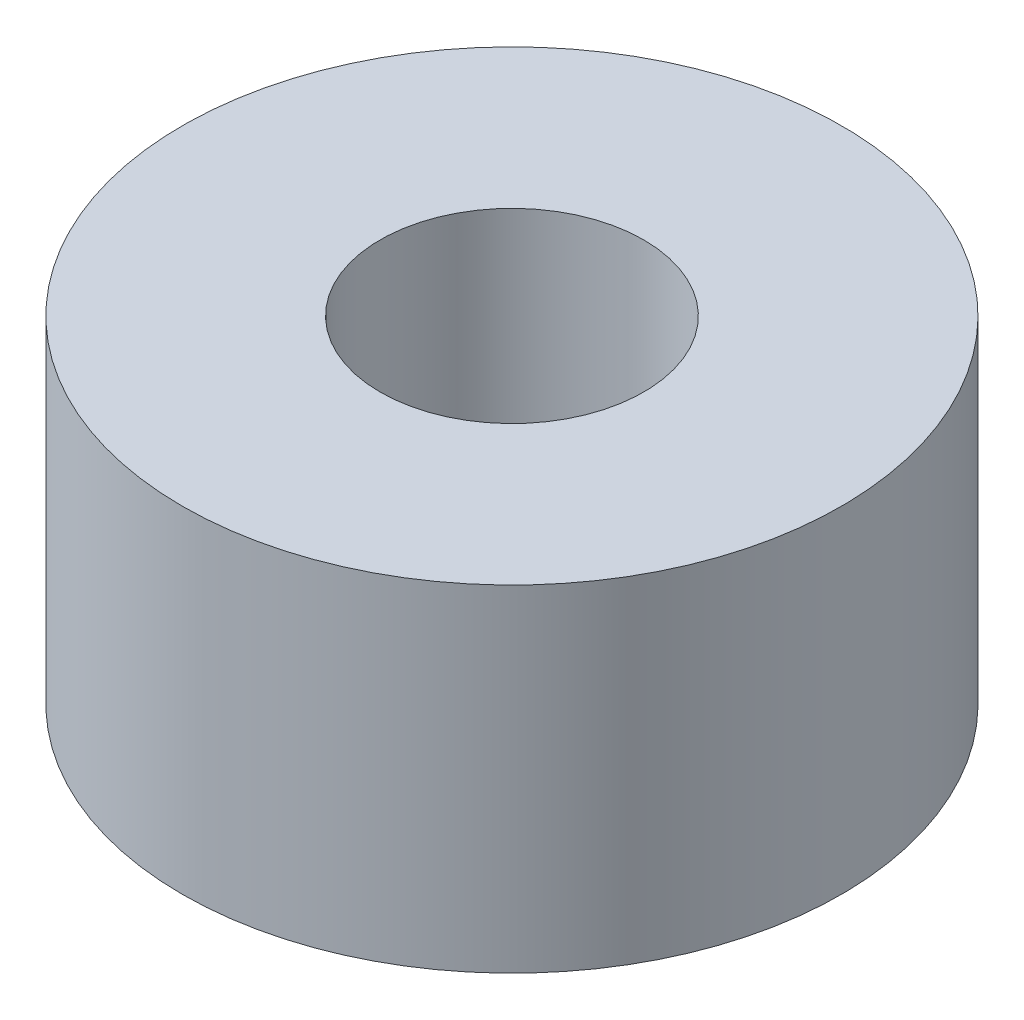
ISO-10303-21;
HEADER;
FILE_DESCRIPTION(('STEP AP214'),'2;1');
FILE_NAME('part.step','',(''),(''),'','','');
FILE_SCHEMA(('AUTOMOTIVE_DESIGN { 1 0 10303 214 1 1 1 1 }'));
ENDSEC;
DATA;
#1=APPLICATION_CONTEXT('core data for automotive mechanical design processes');
#2=APPLICATION_PROTOCOL_DEFINITION('international standard','automotive_design',2000,#1);
#3=PRODUCT_CONTEXT('',#1,'mechanical');
#4=PRODUCT('Part','Part','',(#3));
#5=PRODUCT_RELATED_PRODUCT_CATEGORY('part','',(#4));
#6=PRODUCT_DEFINITION_FORMATION('','',#4);
#7=PRODUCT_DEFINITION_CONTEXT('part definition',#1,'design');
#8=PRODUCT_DEFINITION('design','',#6,#7);
#9=PRODUCT_DEFINITION_SHAPE('','',#8);
#10=(LENGTH_UNIT() NAMED_UNIT(*) SI_UNIT(.MILLI.,.METRE.));
#11=(NAMED_UNIT(*) PLANE_ANGLE_UNIT() SI_UNIT($,.RADIAN.));
#12=(NAMED_UNIT(*) SI_UNIT($,.STERADIAN.) SOLID_ANGLE_UNIT());
#13=UNCERTAINTY_MEASURE_WITH_UNIT(LENGTH_MEASURE(1.E-05),#10,'distance_accuracy_value','');
#14=(GEOMETRIC_REPRESENTATION_CONTEXT(3) GLOBAL_UNCERTAINTY_ASSIGNED_CONTEXT((#13)) GLOBAL_UNIT_ASSIGNED_CONTEXT((#10,
#11,#12)) REPRESENTATION_CONTEXT('',''));
#15=CARTESIAN_POINT('',(0.,0.,0.));
#16=DIRECTION('',(0.,0.,1.));
#17=DIRECTION('',(1.,0.,0.));
#18=AXIS2_PLACEMENT_3D('',#15,#16,#17);
#19=CARTESIAN_POINT('',(0.,2.55,0.));
#20=DIRECTION('',(0.,1.,0.));
#21=DIRECTION('',(0.,0.,1.));
#22=AXIS2_PLACEMENT_3D('',#19,#20,#21);
#23=PLANE('',#22);
#24=CARTESIAN_POINT('',(0.,2.55,0.));
#25=DIRECTION('',(0.,1.,0.));
#26=DIRECTION('',(0.,0.,1.));
#27=AXIS2_PLACEMENT_3D('',#24,#25,#26);
#28=CIRCLE('',#27,5.);
#29=CARTESIAN_POINT('',(0.,2.55,5.));
#30=VERTEX_POINT('',#29);
#31=EDGE_CURVE('E10',#30,#30,#28,.T.);
#32=ORIENTED_EDGE('',*,*,#31,.T.);
#33=EDGE_LOOP('',(#32));
#34=FACE_BOUND('',#33,.T.);
#35=CARTESIAN_POINT('',(0.,2.55,0.));
#36=DIRECTION('',(0.,1.,0.));
#37=DIRECTION('',(0.,0.,1.));
#38=AXIS2_PLACEMENT_3D('',#35,#36,#37);
#39=CIRCLE('',#38,2.);
#40=CARTESIAN_POINT('',(0.,2.55,2.));
#41=VERTEX_POINT('',#40);
#42=EDGE_CURVE('E50',#41,#41,#39,.T.);
#43=ORIENTED_EDGE('',*,*,#42,.F.);
#44=EDGE_LOOP('',(#43));
#45=FACE_BOUND('',#44,.T.);
#46=ADVANCED_FACE('F37',(#34,#45),#23,.T.);
#47=CARTESIAN_POINT('',(0.,-2.55,0.));
#48=DIRECTION('',(0.,1.,0.));
#49=DIRECTION('',(0.,0.,1.));
#50=AXIS2_PLACEMENT_3D('',#47,#48,#49);
#51=PLANE('',#50);
#52=CARTESIAN_POINT('',(0.,-2.55,0.));
#53=DIRECTION('',(0.,1.,0.));
#54=DIRECTION('',(0.,0.,1.));
#55=AXIS2_PLACEMENT_3D('',#52,#53,#54);
#56=CIRCLE('',#55,5.);
#57=CARTESIAN_POINT('',(0.,-2.55,5.));
#58=VERTEX_POINT('',#57);
#59=EDGE_CURVE('E41',#58,#58,#56,.T.);
#60=ORIENTED_EDGE('',*,*,#59,.F.);
#61=EDGE_LOOP('',(#60));
#62=FACE_BOUND('',#61,.T.);
#63=CARTESIAN_POINT('',(0.,-2.55,0.));
#64=DIRECTION('',(0.,1.,0.));
#65=DIRECTION('',(0.,0.,1.));
#66=AXIS2_PLACEMENT_3D('',#63,#64,#65);
#67=CIRCLE('',#66,2.);
#68=CARTESIAN_POINT('',(0.,-2.55,2.));
#69=VERTEX_POINT('',#68);
#70=EDGE_CURVE('E52',#69,#69,#67,.T.);
#71=ORIENTED_EDGE('',*,*,#70,.T.);
#72=EDGE_LOOP('',(#71));
#73=FACE_BOUND('',#72,.T.);
#74=ADVANCED_FACE('F64',(#62,#73),#51,.F.);
#75=CARTESIAN_POINT('',(0.,2.55,0.));
#76=DIRECTION('',(0.,-1.,0.));
#77=DIRECTION('',(0.,0.,-1.));
#78=AXIS2_PLACEMENT_3D('',#75,#76,#77);
#79=CYLINDRICAL_SURFACE('',#78,5.);
#80=ORIENTED_EDGE('',*,*,#31,.F.);
#81=EDGE_LOOP('',(#80));
#82=FACE_BOUND('',#81,.T.);
#83=ORIENTED_EDGE('',*,*,#59,.T.);
#84=EDGE_LOOP('',(#83));
#85=FACE_BOUND('',#84,.T.);
#86=ADVANCED_FACE('F39',(#82,#85),#79,.T.);
#87=CARTESIAN_POINT('',(0.,2.55,0.));
#88=DIRECTION('',(0.,-1.,0.));
#89=DIRECTION('',(0.,0.,-1.));
#90=AXIS2_PLACEMENT_3D('',#87,#88,#89);
#91=CYLINDRICAL_SURFACE('',#90,2.);
#92=ORIENTED_EDGE('',*,*,#42,.T.);
#93=EDGE_LOOP('',(#92));
#94=FACE_BOUND('',#93,.T.);
#95=ORIENTED_EDGE('',*,*,#70,.F.);
#96=EDGE_LOOP('',(#95));
#97=FACE_BOUND('',#96,.T.);
#98=ADVANCED_FACE('F60',(#94,#97),#91,.F.);
#99=CLOSED_SHELL('',(#46,#74,#86,#98));
#100=MANIFOLD_SOLID_BREP('B2',#99);
#101=ADVANCED_BREP_SHAPE_REPRESENTATION('',(#18,#100),#14);
#102=SHAPE_DEFINITION_REPRESENTATION(#9,#101);
ENDSEC;
END-ISO-10303-21;
